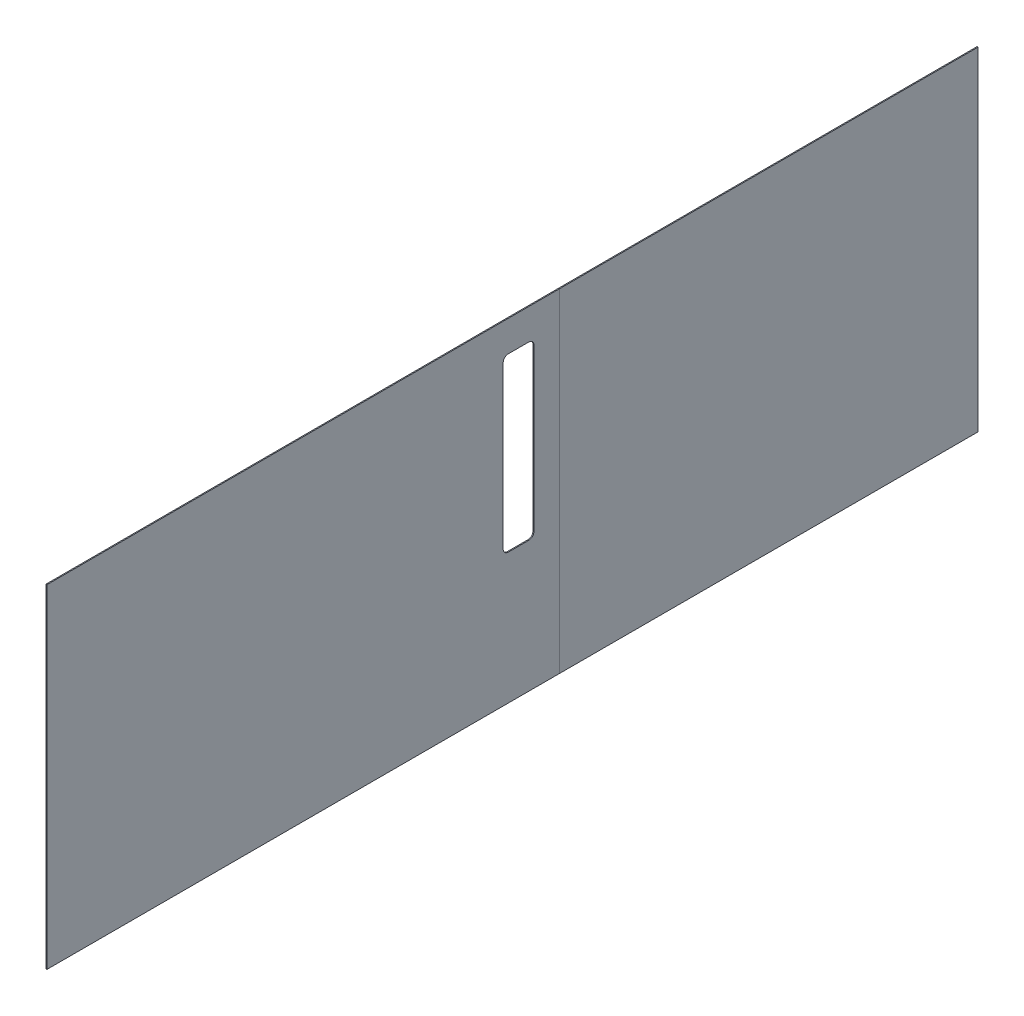
ISO-10303-21;
HEADER;
FILE_DESCRIPTION(('STEP AP214'),'2;1');
FILE_NAME('part.step','',(''),(''),'','','');
FILE_SCHEMA(('AUTOMOTIVE_DESIGN { 1 0 10303 214 1 1 1 1 }'));
ENDSEC;
DATA;
#1=APPLICATION_CONTEXT('core data for automotive mechanical design processes');
#2=APPLICATION_PROTOCOL_DEFINITION('international standard','automotive_design',2000,#1);
#3=PRODUCT_CONTEXT('',#1,'mechanical');
#4=PRODUCT('Part','Part','',(#3));
#5=PRODUCT_RELATED_PRODUCT_CATEGORY('part','',(#4));
#6=PRODUCT_DEFINITION_FORMATION('','',#4);
#7=PRODUCT_DEFINITION_CONTEXT('part definition',#1,'design');
#8=PRODUCT_DEFINITION('design','',#6,#7);
#9=PRODUCT_DEFINITION_SHAPE('','',#8);
#10=(LENGTH_UNIT() NAMED_UNIT(*) SI_UNIT(.MILLI.,.METRE.));
#11=(NAMED_UNIT(*) PLANE_ANGLE_UNIT() SI_UNIT($,.RADIAN.));
#12=(NAMED_UNIT(*) SI_UNIT($,.STERADIAN.) SOLID_ANGLE_UNIT());
#13=UNCERTAINTY_MEASURE_WITH_UNIT(LENGTH_MEASURE(1.E-05),#10,'distance_accuracy_value','');
#14=(GEOMETRIC_REPRESENTATION_CONTEXT(3) GLOBAL_UNCERTAINTY_ASSIGNED_CONTEXT((#13)) GLOBAL_UNIT_ASSIGNED_CONTEXT((#10,
#11,#12)) REPRESENTATION_CONTEXT('',''));
#15=CARTESIAN_POINT('',(0.,0.,0.));
#16=DIRECTION('',(0.,0.,1.));
#17=DIRECTION('',(1.,0.,0.));
#18=AXIS2_PLACEMENT_3D('',#15,#16,#17);
#19=CARTESIAN_POINT('',(-1.88013383391161,0.,0.161176834194605));
#20=DIRECTION('',(0.,-1.,0.));
#21=DIRECTION('',(-0.122526572002682,0.,-0.992465233221432));
#22=AXIS2_PLACEMENT_3D('',#19,#20,#21);
#23=PLANE('',#22);
#24=DIRECTION('',(0.,0.,-1.));
#25=VECTOR('',#24,1.);
#26=CARTESIAN_POINT('',(0.,0.,-0.116579537204451));
#27=LINE('',#26,#25);
#28=CARTESIAN_POINT('',(0.,0.,-0.161876725547665));
#29=VERTEX_POINT('',#28);
#30=CARTESIAN_POINT('',(-2.96125970966621E-11,0.,-816.266075646833));
#31=VERTEX_POINT('',#30);
#32=EDGE_CURVE('E95',#29,#31,#27,.T.);
#33=ORIENTED_EDGE('',*,*,#32,.F.);
#34=DIRECTION('',(-1.,0.,0.));
#35=VECTOR('',#34,1.);
#36=CARTESIAN_POINT('',(0.,0.,-0.161876725547735));
#37=LINE('',#36,#35);
#38=CARTESIAN_POINT('',(-1.90000000000001,0.,-0.161876725547665));
#39=VERTEX_POINT('',#38);
#40=EDGE_CURVE('E98',#29,#39,#37,.T.);
#41=ORIENTED_EDGE('',*,*,#40,.T.);
#42=DIRECTION('',(0.,0.,-1.));
#43=VECTOR('',#42,1.);
#44=CARTESIAN_POINT('',(-1.90000000000001,0.,-0.116579537204382));
#45=LINE('',#44,#43);
#46=CARTESIAN_POINT('',(-1.90000000002961,0.,-816.266075646833));
#47=VERTEX_POINT('',#46);
#48=EDGE_CURVE('E82',#39,#47,#45,.T.);
#49=ORIENTED_EDGE('',*,*,#48,.T.);
#50=DIRECTION('',(1.,0.,1.63868918434673E-13));
#51=VECTOR('',#50,1.);
#52=CARTESIAN_POINT('',(-1.90000000002961,0.,-816.266075646833));
#53=LINE('',#52,#51);
#54=EDGE_CURVE('E89',#47,#31,#53,.T.);
#55=ORIENTED_EDGE('',*,*,#54,.T.);
#56=EDGE_LOOP('',(#33,#41,#49,#55));
#57=FACE_BOUND('',#56,.T.);
#58=ADVANCED_FACE('F43',(#57),#23,.T.);
#59=CARTESIAN_POINT('',(0.,650.,-0.116579537204451));
#60=DIRECTION('',(-1.,0.,0.));
#61=DIRECTION('',(0.,0.,1.));
#62=AXIS2_PLACEMENT_3D('',#59,#60,#61);
#63=PLANE('',#62);
#64=ORIENTED_EDGE('',*,*,#32,.T.);
#65=DIRECTION('',(0.,-1.,0.));
#66=VECTOR('',#65,1.);
#67=CARTESIAN_POINT('',(-2.96125970966621E-11,650.,-816.266075646833));
#68=LINE('',#67,#66);
#69=CARTESIAN_POINT('',(-2.96125970966621E-11,650.,-816.266075646833));
#70=VERTEX_POINT('',#69);
#71=EDGE_CURVE('E86',#70,#31,#68,.T.);
#72=ORIENTED_EDGE('',*,*,#71,.F.);
#73=DIRECTION('',(0.,0.,-1.));
#74=VECTOR('',#73,1.);
#75=CARTESIAN_POINT('',(0.,650.,-0.116579537204451));
#76=LINE('',#75,#74);
#77=CARTESIAN_POINT('',(0.,650.,-0.161876725547735));
#78=VERTEX_POINT('',#77);
#79=EDGE_CURVE('E99',#78,#70,#76,.T.);
#80=ORIENTED_EDGE('',*,*,#79,.F.);
#81=DIRECTION('',(0.,-1.,0.));
#82=VECTOR('',#81,1.);
#83=CARTESIAN_POINT('',(0.,650.,-0.161876725547735));
#84=LINE('',#83,#82);
#85=EDGE_CURVE('E50',#78,#29,#84,.T.);
#86=ORIENTED_EDGE('',*,*,#85,.T.);
#87=EDGE_LOOP('',(#64,#72,#80,#86));
#88=FACE_BOUND('',#87,.T.);
#89=ADVANCED_FACE('F112',(#88),#63,.F.);
#90=CARTESIAN_POINT('',(-1.90000000002961,650.,-816.266075646833));
#91=DIRECTION('',(1.63868918434673E-13,0.,-1.));
#92=DIRECTION('',(-1.,0.,-1.63868918434673E-13));
#93=AXIS2_PLACEMENT_3D('',#90,#91,#92);
#94=PLANE('',#93);
#95=ORIENTED_EDGE('',*,*,#54,.F.);
#96=DIRECTION('',(0.,-1.,0.));
#97=VECTOR('',#96,1.);
#98=CARTESIAN_POINT('',(-1.90000000002961,650.,-816.266075646833));
#99=LINE('',#98,#97);
#100=CARTESIAN_POINT('',(-1.90000000002961,650.,-816.266075646833));
#101=VERTEX_POINT('',#100);
#102=EDGE_CURVE('E65',#101,#47,#99,.T.);
#103=ORIENTED_EDGE('',*,*,#102,.F.);
#104=DIRECTION('',(1.,0.,1.63868918434673E-13));
#105=VECTOR('',#104,1.);
#106=CARTESIAN_POINT('',(-1.90000000002961,650.,-816.266075646833));
#107=LINE('',#106,#105);
#108=EDGE_CURVE('E101',#101,#70,#107,.T.);
#109=ORIENTED_EDGE('',*,*,#108,.T.);
#110=ORIENTED_EDGE('',*,*,#71,.T.);
#111=EDGE_LOOP('',(#95,#103,#109,#110));
#112=FACE_BOUND('',#111,.T.);
#113=ADVANCED_FACE('F90',(#112),#94,.T.);
#114=CARTESIAN_POINT('',(-1.90000000000001,650.,-0.116579537204382));
#115=DIRECTION('',(-1.,0.,0.));
#116=DIRECTION('',(0.,0.,1.));
#117=AXIS2_PLACEMENT_3D('',#114,#115,#116);
#118=PLANE('',#117);
#119=ORIENTED_EDGE('',*,*,#48,.F.);
#120=DIRECTION('',(0.,-1.,0.));
#121=VECTOR('',#120,1.);
#122=CARTESIAN_POINT('',(-1.90000000000001,650.,-0.161876725547666));
#123=LINE('',#122,#121);
#124=CARTESIAN_POINT('',(-1.90000000000001,650.,-0.161876725547665));
#125=VERTEX_POINT('',#124);
#126=EDGE_CURVE('E106',#125,#39,#123,.T.);
#127=ORIENTED_EDGE('',*,*,#126,.F.);
#128=DIRECTION('',(0.,0.,-1.));
#129=VECTOR('',#128,1.);
#130=CARTESIAN_POINT('',(-1.90000000000001,650.,-0.116579537204382));
#131=LINE('',#130,#129);
#132=EDGE_CURVE('E85',#125,#101,#131,.T.);
#133=ORIENTED_EDGE('',*,*,#132,.T.);
#134=ORIENTED_EDGE('',*,*,#102,.T.);
#135=EDGE_LOOP('',(#119,#127,#133,#134));
#136=FACE_BOUND('',#135,.T.);
#137=ADVANCED_FACE('F78',(#136),#118,.T.);
#138=CARTESIAN_POINT('',(0.736600000000003,650.,-0.161876725547762));
#139=DIRECTION('',(0.,1.,0.));
#140=DIRECTION('',(0.992465233221432,0.,-0.122526572002682));
#141=AXIS2_PLACEMENT_3D('',#138,#139,#140);
#142=PLANE('',#141);
#143=ORIENTED_EDGE('',*,*,#79,.T.);
#144=ORIENTED_EDGE('',*,*,#108,.F.);
#145=ORIENTED_EDGE('',*,*,#132,.F.);
#146=DIRECTION('',(1.,0.,0.));
#147=VECTOR('',#146,1.);
#148=CARTESIAN_POINT('',(-1.90000000000001,650.,-0.161876725547666));
#149=LINE('',#148,#147);
#150=EDGE_CURVE('E11',#125,#78,#149,.T.);
#151=ORIENTED_EDGE('',*,*,#150,.T.);
#152=EDGE_LOOP('',(#143,#144,#145,#151));
#153=FACE_BOUND('',#152,.T.);
#154=ADVANCED_FACE('F207',(#153),#142,.T.);
#155=CARTESIAN_POINT('',(0.,650.,1000.));
#156=DIRECTION('',(0.,0.,1.));
#157=DIRECTION('',(1.,0.,0.));
#158=AXIS2_PLACEMENT_3D('',#155,#156,#157);
#159=PLANE('',#158);
#160=DIRECTION('',(-1.,0.,0.));
#161=VECTOR('',#160,1.);
#162=CARTESIAN_POINT('',(0.,0.,1000.));
#163=LINE('',#162,#161);
#164=CARTESIAN_POINT('',(0.,0.,1000.));
#165=VERTEX_POINT('',#164);
#166=CARTESIAN_POINT('',(-1.9,0.,1000.));
#167=VERTEX_POINT('',#166);
#168=EDGE_CURVE('E250',#165,#167,#163,.T.);
#169=ORIENTED_EDGE('',*,*,#168,.F.);
#170=DIRECTION('',(0.,-1.,0.));
#171=VECTOR('',#170,1.);
#172=CARTESIAN_POINT('',(0.,650.,1000.));
#173=LINE('',#172,#171);
#174=CARTESIAN_POINT('',(0.,650.,1000.));
#175=VERTEX_POINT('',#174);
#176=EDGE_CURVE('E217',#175,#165,#173,.T.);
#177=ORIENTED_EDGE('',*,*,#176,.F.);
#178=DIRECTION('',(-1.,0.,0.));
#179=VECTOR('',#178,1.);
#180=CARTESIAN_POINT('',(0.,650.,1000.));
#181=LINE('',#180,#179);
#182=CARTESIAN_POINT('',(-1.9,650.,1000.));
#183=VERTEX_POINT('',#182);
#184=EDGE_CURVE('E304',#175,#183,#181,.T.);
#185=ORIENTED_EDGE('',*,*,#184,.T.);
#186=DIRECTION('',(0.,-1.,0.));
#187=VECTOR('',#186,1.);
#188=CARTESIAN_POINT('',(-1.9,650.,1000.));
#189=LINE('',#188,#187);
#190=EDGE_CURVE('E302',#183,#167,#189,.T.);
#191=ORIENTED_EDGE('',*,*,#190,.T.);
#192=EDGE_LOOP('',(#169,#177,#185,#191));
#193=FACE_BOUND('',#192,.T.);
#194=ADVANCED_FACE('F325',(#193),#159,.T.);
#195=CARTESIAN_POINT('',(100.,580.,110.));
#196=DIRECTION('',(0.,0.,1.));
#197=DIRECTION('',(0.,-1.,0.));
#198=AXIS2_PLACEMENT_3D('',#195,#196,#197);
#199=PLANE('',#198);
#200=DIRECTION('',(-1.,0.,0.));
#201=VECTOR('',#200,1.);
#202=CARTESIAN_POINT('',(100.,265.,110.));
#203=LINE('',#202,#201);
#204=CARTESIAN_POINT('',(0.,265.,110.));
#205=VERTEX_POINT('',#204);
#206=CARTESIAN_POINT('',(-1.9,265.,110.));
#207=VERTEX_POINT('',#206);
#208=EDGE_CURVE('E299',#205,#207,#203,.T.);
#209=ORIENTED_EDGE('',*,*,#208,.T.);
#210=DIRECTION('',(0.,1.,0.));
#211=VECTOR('',#210,1.);
#212=CARTESIAN_POINT('',(-1.9,580.,110.));
#213=LINE('',#212,#211);
#214=CARTESIAN_POINT('',(-1.9,580.,110.));
#215=VERTEX_POINT('',#214);
#216=EDGE_CURVE('E296',#207,#215,#213,.T.);
#217=ORIENTED_EDGE('',*,*,#216,.T.);
#218=DIRECTION('',(-1.,0.,0.));
#219=VECTOR('',#218,1.);
#220=CARTESIAN_POINT('',(100.,580.,110.));
#221=LINE('',#220,#219);
#222=CARTESIAN_POINT('',(0.,580.,110.));
#223=VERTEX_POINT('',#222);
#224=EDGE_CURVE('E294',#223,#215,#221,.T.);
#225=ORIENTED_EDGE('',*,*,#224,.F.);
#226=DIRECTION('',(0.,1.,0.));
#227=VECTOR('',#226,1.);
#228=CARTESIAN_POINT('',(0.,650.,110.));
#229=LINE('',#228,#227);
#230=EDGE_CURVE('E241',#205,#223,#229,.T.);
#231=ORIENTED_EDGE('',*,*,#230,.F.);
#232=EDGE_LOOP('',(#209,#217,#225,#231));
#233=FACE_BOUND('',#232,.T.);
#234=ADVANCED_FACE('F327',(#233),#199,.F.);
#235=CARTESIAN_POINT('',(100.,580.,100.));
#236=DIRECTION('',(-1.,0.,0.));
#237=DIRECTION('',(0.,0.,1.));
#238=AXIS2_PLACEMENT_3D('',#235,#236,#237);
#239=CYLINDRICAL_SURFACE('',#238,10.);
#240=ORIENTED_EDGE('',*,*,#224,.T.);
#241=CARTESIAN_POINT('',(-1.9,580.,100.));
#242=DIRECTION('',(-1.,0.,0.));
#243=DIRECTION('',(0.,0.,-1.));
#244=AXIS2_PLACEMENT_3D('',#241,#242,#243);
#245=CIRCLE('',#244,10.);
#246=CARTESIAN_POINT('',(-1.9,590.,100.));
#247=VERTEX_POINT('',#246);
#248=EDGE_CURVE('E291',#215,#247,#245,.T.);
#249=ORIENTED_EDGE('',*,*,#248,.T.);
#250=DIRECTION('',(-1.,0.,0.));
#251=VECTOR('',#250,1.);
#252=CARTESIAN_POINT('',(100.,590.,100.));
#253=LINE('',#252,#251);
#254=CARTESIAN_POINT('',(0.,590.,100.));
#255=VERTEX_POINT('',#254);
#256=EDGE_CURVE('E289',#255,#247,#253,.T.);
#257=ORIENTED_EDGE('',*,*,#256,.F.);
#258=CARTESIAN_POINT('',(0.,580.,100.));
#259=DIRECTION('',(-1.,0.,0.));
#260=DIRECTION('',(0.,0.,1.));
#261=AXIS2_PLACEMENT_3D('',#258,#259,#260);
#262=CIRCLE('',#261,10.);
#263=EDGE_CURVE('E238',#223,#255,#262,.T.);
#264=ORIENTED_EDGE('',*,*,#263,.F.);
#265=EDGE_LOOP('',(#240,#249,#257,#264));
#266=FACE_BOUND('',#265,.T.);
#267=ADVANCED_FACE('F333',(#266),#239,.F.);
#268=CARTESIAN_POINT('',(100.,590.,60.));
#269=DIRECTION('',(0.,1.,0.));
#270=DIRECTION('',(0.,0.,1.));
#271=AXIS2_PLACEMENT_3D('',#268,#269,#270);
#272=PLANE('',#271);
#273=ORIENTED_EDGE('',*,*,#256,.T.);
#274=DIRECTION('',(0.,0.,-1.));
#275=VECTOR('',#274,1.);
#276=CARTESIAN_POINT('',(-1.9,590.,60.));
#277=LINE('',#276,#275);
#278=CARTESIAN_POINT('',(-1.9,590.,60.));
#279=VERTEX_POINT('',#278);
#280=EDGE_CURVE('E286',#247,#279,#277,.T.);
#281=ORIENTED_EDGE('',*,*,#280,.T.);
#282=DIRECTION('',(-1.,0.,0.));
#283=VECTOR('',#282,1.);
#284=CARTESIAN_POINT('',(100.,590.,60.));
#285=LINE('',#284,#283);
#286=CARTESIAN_POINT('',(0.,590.,60.));
#287=VERTEX_POINT('',#286);
#288=EDGE_CURVE('E284',#287,#279,#285,.T.);
#289=ORIENTED_EDGE('',*,*,#288,.F.);
#290=DIRECTION('',(0.,0.,-1.));
#291=VECTOR('',#290,1.);
#292=CARTESIAN_POINT('',(0.,590.,1000.));
#293=LINE('',#292,#291);
#294=EDGE_CURVE('E235',#255,#287,#293,.T.);
#295=ORIENTED_EDGE('',*,*,#294,.F.);
#296=EDGE_LOOP('',(#273,#281,#289,#295));
#297=FACE_BOUND('',#296,.T.);
#298=ADVANCED_FACE('F378',(#297),#272,.F.);
#299=CARTESIAN_POINT('',(100.,580.,60.));
#300=DIRECTION('',(-1.,0.,0.));
#301=DIRECTION('',(0.,0.,1.));
#302=AXIS2_PLACEMENT_3D('',#299,#300,#301);
#303=CYLINDRICAL_SURFACE('',#302,10.);
#304=ORIENTED_EDGE('',*,*,#288,.T.);
#305=CARTESIAN_POINT('',(-1.9,580.,60.));
#306=DIRECTION('',(-1.,0.,0.));
#307=DIRECTION('',(0.,0.,1.));
#308=AXIS2_PLACEMENT_3D('',#305,#306,#307);
#309=CIRCLE('',#308,10.);
#310=CARTESIAN_POINT('',(-1.9,580.,50.));
#311=VERTEX_POINT('',#310);
#312=EDGE_CURVE('E281',#279,#311,#309,.T.);
#313=ORIENTED_EDGE('',*,*,#312,.T.);
#314=DIRECTION('',(-1.,0.,0.));
#315=VECTOR('',#314,1.);
#316=CARTESIAN_POINT('',(100.,580.,50.));
#317=LINE('',#316,#315);
#318=CARTESIAN_POINT('',(0.,580.,50.));
#319=VERTEX_POINT('',#318);
#320=EDGE_CURVE('E279',#319,#311,#317,.T.);
#321=ORIENTED_EDGE('',*,*,#320,.F.);
#322=CARTESIAN_POINT('',(0.,580.,60.));
#323=DIRECTION('',(-1.,0.,0.));
#324=DIRECTION('',(0.,0.,1.));
#325=AXIS2_PLACEMENT_3D('',#322,#323,#324);
#326=CIRCLE('',#325,10.);
#327=EDGE_CURVE('E232',#287,#319,#326,.T.);
#328=ORIENTED_EDGE('',*,*,#327,.F.);
#329=EDGE_LOOP('',(#304,#313,#321,#328));
#330=FACE_BOUND('',#329,.T.);
#331=ADVANCED_FACE('F374',(#330),#303,.F.);
#332=CARTESIAN_POINT('',(100.,580.,50.));
#333=DIRECTION('',(0.,0.,-1.));
#334=DIRECTION('',(0.,1.,0.));
#335=AXIS2_PLACEMENT_3D('',#332,#333,#334);
#336=PLANE('',#335);
#337=ORIENTED_EDGE('',*,*,#320,.T.);
#338=DIRECTION('',(0.,-1.,0.));
#339=VECTOR('',#338,1.);
#340=CARTESIAN_POINT('',(-1.9,580.,50.));
#341=LINE('',#340,#339);
#342=CARTESIAN_POINT('',(-1.9,265.,50.));
#343=VERTEX_POINT('',#342);
#344=EDGE_CURVE('E276',#311,#343,#341,.T.);
#345=ORIENTED_EDGE('',*,*,#344,.T.);
#346=DIRECTION('',(-1.,0.,0.));
#347=VECTOR('',#346,1.);
#348=CARTESIAN_POINT('',(100.,265.,50.));
#349=LINE('',#348,#347);
#350=CARTESIAN_POINT('',(0.,265.,50.));
#351=VERTEX_POINT('',#350);
#352=EDGE_CURVE('E274',#351,#343,#349,.T.);
#353=ORIENTED_EDGE('',*,*,#352,.F.);
#354=DIRECTION('',(0.,-1.,0.));
#355=VECTOR('',#354,1.);
#356=CARTESIAN_POINT('',(0.,650.,49.9999999999999));
#357=LINE('',#356,#355);
#358=EDGE_CURVE('E229',#319,#351,#357,.T.);
#359=ORIENTED_EDGE('',*,*,#358,.F.);
#360=EDGE_LOOP('',(#337,#345,#353,#359));
#361=FACE_BOUND('',#360,.T.);
#362=ADVANCED_FACE('F370',(#361),#336,.F.);
#363=CARTESIAN_POINT('',(100.,265.,60.));
#364=DIRECTION('',(-1.,0.,0.));
#365=DIRECTION('',(0.,0.,1.));
#366=AXIS2_PLACEMENT_3D('',#363,#364,#365);
#367=CYLINDRICAL_SURFACE('',#366,10.);
#368=ORIENTED_EDGE('',*,*,#352,.T.);
#369=CARTESIAN_POINT('',(-1.9,265.,60.));
#370=DIRECTION('',(-1.,0.,0.));
#371=DIRECTION('',(0.,0.,1.));
#372=AXIS2_PLACEMENT_3D('',#369,#370,#371);
#373=CIRCLE('',#372,10.);
#374=CARTESIAN_POINT('',(-1.9,255.,60.));
#375=VERTEX_POINT('',#374);
#376=EDGE_CURVE('E271',#343,#375,#373,.T.);
#377=ORIENTED_EDGE('',*,*,#376,.T.);
#378=DIRECTION('',(-1.,0.,0.));
#379=VECTOR('',#378,1.);
#380=CARTESIAN_POINT('',(100.,255.,60.));
#381=LINE('',#380,#379);
#382=CARTESIAN_POINT('',(0.,255.,60.));
#383=VERTEX_POINT('',#382);
#384=EDGE_CURVE('E269',#383,#375,#381,.T.);
#385=ORIENTED_EDGE('',*,*,#384,.F.);
#386=CARTESIAN_POINT('',(0.,265.,60.));
#387=DIRECTION('',(-1.,0.,0.));
#388=DIRECTION('',(0.,0.,1.));
#389=AXIS2_PLACEMENT_3D('',#386,#387,#388);
#390=CIRCLE('',#389,10.);
#391=EDGE_CURVE('E226',#351,#383,#390,.T.);
#392=ORIENTED_EDGE('',*,*,#391,.F.);
#393=EDGE_LOOP('',(#368,#377,#385,#392));
#394=FACE_BOUND('',#393,.T.);
#395=ADVANCED_FACE('F366',(#394),#367,.F.);
#396=CARTESIAN_POINT('',(100.,255.,60.));
#397=DIRECTION('',(0.,-1.,0.));
#398=DIRECTION('',(0.,0.,-1.));
#399=AXIS2_PLACEMENT_3D('',#396,#397,#398);
#400=PLANE('',#399);
#401=ORIENTED_EDGE('',*,*,#384,.T.);
#402=DIRECTION('',(0.,0.,1.));
#403=VECTOR('',#402,1.);
#404=CARTESIAN_POINT('',(-1.9,255.,60.));
#405=LINE('',#404,#403);
#406=CARTESIAN_POINT('',(-1.9,255.,100.));
#407=VERTEX_POINT('',#406);
#408=EDGE_CURVE('E266',#375,#407,#405,.T.);
#409=ORIENTED_EDGE('',*,*,#408,.T.);
#410=DIRECTION('',(-1.,0.,0.));
#411=VECTOR('',#410,1.);
#412=CARTESIAN_POINT('',(100.,255.,100.));
#413=LINE('',#412,#411);
#414=CARTESIAN_POINT('',(0.,255.,100.));
#415=VERTEX_POINT('',#414);
#416=EDGE_CURVE('E264',#415,#407,#413,.T.);
#417=ORIENTED_EDGE('',*,*,#416,.F.);
#418=DIRECTION('',(0.,0.,1.));
#419=VECTOR('',#418,1.);
#420=CARTESIAN_POINT('',(0.,254.999999999999,999.999999999999));
#421=LINE('',#420,#419);
#422=EDGE_CURVE('E247',#383,#415,#421,.T.);
#423=ORIENTED_EDGE('',*,*,#422,.F.);
#424=EDGE_LOOP('',(#401,#409,#417,#423));
#425=FACE_BOUND('',#424,.T.);
#426=ADVANCED_FACE('F362',(#425),#400,.F.);
#427=CARTESIAN_POINT('',(100.,265.,100.));
#428=DIRECTION('',(-1.,0.,0.));
#429=DIRECTION('',(0.,0.,1.));
#430=AXIS2_PLACEMENT_3D('',#427,#428,#429);
#431=CYLINDRICAL_SURFACE('',#430,10.);
#432=ORIENTED_EDGE('',*,*,#416,.T.);
#433=CARTESIAN_POINT('',(-1.9,265.,100.));
#434=DIRECTION('',(-1.,0.,0.));
#435=DIRECTION('',(0.,0.,1.));
#436=AXIS2_PLACEMENT_3D('',#433,#434,#435);
#437=CIRCLE('',#436,10.);
#438=EDGE_CURVE('E262',#407,#207,#437,.T.);
#439=ORIENTED_EDGE('',*,*,#438,.T.);
#440=ORIENTED_EDGE('',*,*,#208,.F.);
#441=CARTESIAN_POINT('',(0.,265.,100.));
#442=DIRECTION('',(-1.,0.,0.));
#443=DIRECTION('',(0.,0.,1.));
#444=AXIS2_PLACEMENT_3D('',#441,#442,#443);
#445=CIRCLE('',#444,10.);
#446=EDGE_CURVE('E244',#415,#205,#445,.T.);
#447=ORIENTED_EDGE('',*,*,#446,.F.);
#448=EDGE_LOOP('',(#432,#439,#440,#447));
#449=FACE_BOUND('',#448,.T.);
#450=ADVANCED_FACE('F358',(#449),#431,.F.);
#451=CARTESIAN_POINT('',(-1.9,650.,1000.));
#452=DIRECTION('',(-1.,0.,0.));
#453=DIRECTION('',(0.,0.,1.));
#454=AXIS2_PLACEMENT_3D('',#451,#452,#453);
#455=PLANE('',#454);
#456=ORIENTED_EDGE('',*,*,#438,.F.);
#457=ORIENTED_EDGE('',*,*,#408,.F.);
#458=ORIENTED_EDGE('',*,*,#376,.F.);
#459=ORIENTED_EDGE('',*,*,#344,.F.);
#460=ORIENTED_EDGE('',*,*,#312,.F.);
#461=ORIENTED_EDGE('',*,*,#280,.F.);
#462=ORIENTED_EDGE('',*,*,#248,.F.);
#463=ORIENTED_EDGE('',*,*,#216,.F.);
#464=EDGE_LOOP('',(#456,#457,#458,#459,#460,#461,#462,#463));
#465=FACE_BOUND('',#464,.T.);
#466=DIRECTION('',(0.,0.,-1.));
#467=VECTOR('',#466,1.);
#468=CARTESIAN_POINT('',(-1.9,0.,1000.));
#469=LINE('',#468,#467);
#470=CARTESIAN_POINT('',(-1.90000000000001,0.,0.0452971883438525));
#471=VERTEX_POINT('',#470);
#472=EDGE_CURVE('E254',#167,#471,#469,.T.);
#473=ORIENTED_EDGE('',*,*,#472,.F.);
#474=ORIENTED_EDGE('',*,*,#190,.F.);
#475=DIRECTION('',(0.,0.,-1.));
#476=VECTOR('',#475,1.);
#477=CARTESIAN_POINT('',(-1.9,650.,1000.));
#478=LINE('',#477,#476);
#479=CARTESIAN_POINT('',(-1.90000000000001,650.,0.0452971883438525));
#480=VERTEX_POINT('',#479);
#481=EDGE_CURVE('E259',#183,#480,#478,.T.);
#482=ORIENTED_EDGE('',*,*,#481,.T.);
#483=DIRECTION('',(0.,-1.,0.));
#484=VECTOR('',#483,1.);
#485=CARTESIAN_POINT('',(-1.90000000000001,650.,0.0452971883438525));
#486=LINE('',#485,#484);
#487=EDGE_CURVE('E257',#480,#471,#486,.T.);
#488=ORIENTED_EDGE('',*,*,#487,.T.);
#489=EDGE_LOOP('',(#473,#474,#482,#488));
#490=FACE_BOUND('',#489,.T.);
#491=ADVANCED_FACE('F323',(#465,#490),#455,.T.);
#492=CARTESIAN_POINT('',(0.736599999999987,0.,0.045297188343758));
#493=DIRECTION('',(0.,1.,0.));
#494=DIRECTION('',(1.,0.,0.));
#495=AXIS2_PLACEMENT_3D('',#492,#493,#494);
#496=PLANE('',#495);
#497=ORIENTED_EDGE('',*,*,#472,.T.);
#498=DIRECTION('',(1.,0.,0.));
#499=VECTOR('',#498,1.);
#500=CARTESIAN_POINT('',(-1.90000000000001,0.,0.0452971883438525));
#501=LINE('',#500,#499);
#502=CARTESIAN_POINT('',(0.,0.,0.0452971883437847));
#503=VERTEX_POINT('',#502);
#504=EDGE_CURVE('E199',#471,#503,#501,.T.);
#505=ORIENTED_EDGE('',*,*,#504,.T.);
#506=DIRECTION('',(0.,0.,-1.));
#507=VECTOR('',#506,1.);
#508=CARTESIAN_POINT('',(0.,0.,1000.));
#509=LINE('',#508,#507);
#510=EDGE_CURVE('E223',#165,#503,#509,.T.);
#511=ORIENTED_EDGE('',*,*,#510,.F.);
#512=ORIENTED_EDGE('',*,*,#168,.T.);
#513=EDGE_LOOP('',(#497,#505,#511,#512));
#514=FACE_BOUND('',#513,.T.);
#515=ADVANCED_FACE('F320',(#514),#496,.F.);
#516=CARTESIAN_POINT('',(0.,650.,1000.));
#517=DIRECTION('',(-1.,0.,0.));
#518=DIRECTION('',(0.,0.,1.));
#519=AXIS2_PLACEMENT_3D('',#516,#517,#518);
#520=PLANE('',#519);
#521=ORIENTED_EDGE('',*,*,#422,.T.);
#522=ORIENTED_EDGE('',*,*,#446,.T.);
#523=ORIENTED_EDGE('',*,*,#230,.T.);
#524=ORIENTED_EDGE('',*,*,#263,.T.);
#525=ORIENTED_EDGE('',*,*,#294,.T.);
#526=ORIENTED_EDGE('',*,*,#327,.T.);
#527=ORIENTED_EDGE('',*,*,#358,.T.);
#528=ORIENTED_EDGE('',*,*,#391,.T.);
#529=EDGE_LOOP('',(#521,#522,#523,#524,#525,#526,#527,#528));
#530=FACE_BOUND('',#529,.T.);
#531=ORIENTED_EDGE('',*,*,#510,.T.);
#532=DIRECTION('',(0.,-1.,0.));
#533=VECTOR('',#532,1.);
#534=CARTESIAN_POINT('',(0.,650.,0.0452971883437847));
#535=LINE('',#534,#533);
#536=CARTESIAN_POINT('',(0.,650.,0.0452971883438525));
#537=VERTEX_POINT('',#536);
#538=EDGE_CURVE('E307',#537,#503,#535,.T.);
#539=ORIENTED_EDGE('',*,*,#538,.F.);
#540=DIRECTION('',(0.,0.,-1.));
#541=VECTOR('',#540,1.);
#542=CARTESIAN_POINT('',(0.,650.,1000.));
#543=LINE('',#542,#541);
#544=EDGE_CURVE('E212',#175,#537,#543,.T.);
#545=ORIENTED_EDGE('',*,*,#544,.F.);
#546=ORIENTED_EDGE('',*,*,#176,.T.);
#547=EDGE_LOOP('',(#531,#539,#545,#546));
#548=FACE_BOUND('',#547,.T.);
#549=ADVANCED_FACE('F316',(#530,#548),#520,.F.);
#550=CARTESIAN_POINT('',(-1.88013383391167,650.,-0.277756371398422));
#551=DIRECTION('',(0.,1.,0.));
#552=DIRECTION('',(0.,0.,1.));
#553=AXIS2_PLACEMENT_3D('',#550,#551,#552);
#554=PLANE('',#553);
#555=ORIENTED_EDGE('',*,*,#544,.T.);
#556=DIRECTION('',(-1.,0.,0.));
#557=VECTOR('',#556,1.);
#558=CARTESIAN_POINT('',(0.,650.,0.0452971883437847));
#559=LINE('',#558,#557);
#560=EDGE_CURVE('E210',#537,#480,#559,.T.);
#561=ORIENTED_EDGE('',*,*,#560,.T.);
#562=ORIENTED_EDGE('',*,*,#481,.F.);
#563=ORIENTED_EDGE('',*,*,#184,.F.);
#564=EDGE_LOOP('',(#555,#561,#562,#563));
#565=FACE_BOUND('',#564,.T.);
#566=ADVANCED_FACE('F314',(#565),#554,.T.);
#567=CARTESIAN_POINT('',(-1.90000000000001,0.,0.0452971883438525));
#568=DIRECTION('',(0.,-1.,0.));
#569=DIRECTION('',(0.,0.,1.));
#570=AXIS2_PLACEMENT_3D('',#567,#568,#569);
#571=PLANE('',#570);
#572=ORIENTED_EDGE('',*,*,#40,.F.);
#573=DIRECTION('',(0.,0.,1.));
#574=VECTOR('',#573,1.);
#575=CARTESIAN_POINT('',(0.,0.,-0.0582897686019069));
#576=LINE('',#575,#574);
#577=EDGE_CURVE('E183',#29,#503,#576,.T.);
#578=ORIENTED_EDGE('',*,*,#577,.T.);
#579=ORIENTED_EDGE('',*,*,#504,.F.);
#580=DIRECTION('',(0.,0.,1.));
#581=VECTOR('',#580,1.);
#582=CARTESIAN_POINT('',(-1.90000000000001,0.,0.0452971883438525));
#583=LINE('',#582,#581);
#584=EDGE_CURVE('E196',#39,#471,#583,.T.);
#585=ORIENTED_EDGE('',*,*,#584,.F.);
#586=EDGE_LOOP('',(#572,#578,#579,#585));
#587=FACE_BOUND('',#586,.T.);
#588=ADVANCED_FACE('F197',(#587),#571,.T.);
#589=CARTESIAN_POINT('',(-1.90000000000001,650.,0.0452971883438525));
#590=DIRECTION('',(0.,1.,0.));
#591=DIRECTION('',(0.,0.,-1.));
#592=AXIS2_PLACEMENT_3D('',#589,#590,#591);
#593=PLANE('',#592);
#594=ORIENTED_EDGE('',*,*,#560,.F.);
#595=DIRECTION('',(0.,0.,1.));
#596=VECTOR('',#595,1.);
#597=CARTESIAN_POINT('',(0.,650.,-0.0582897686019069));
#598=LINE('',#597,#596);
#599=EDGE_CURVE('E203',#537,#78,#598,.F.);
#600=ORIENTED_EDGE('',*,*,#599,.T.);
#601=ORIENTED_EDGE('',*,*,#150,.F.);
#602=DIRECTION('',(0.,0.,-1.));
#603=VECTOR('',#602,1.);
#604=CARTESIAN_POINT('',(-1.90000000000001,650.,0.0452971883438525));
#605=LINE('',#604,#603);
#606=EDGE_CURVE('E202',#480,#125,#605,.T.);
#607=ORIENTED_EDGE('',*,*,#606,.F.);
#608=EDGE_LOOP('',(#594,#600,#601,#607));
#609=FACE_BOUND('',#608,.T.);
#610=ADVANCED_FACE('F310',(#609),#593,.T.);
#611=CARTESIAN_POINT('',(-1.90000000000001,325.,-0.0582897686019069));
#612=DIRECTION('',(-1.,0.,0.));
#613=DIRECTION('',(0.,0.,1.));
#614=AXIS2_PLACEMENT_3D('',#611,#612,#613);
#615=PLANE('',#614);
#616=ORIENTED_EDGE('',*,*,#606,.T.);
#617=ORIENTED_EDGE('',*,*,#126,.T.);
#618=ORIENTED_EDGE('',*,*,#584,.T.);
#619=ORIENTED_EDGE('',*,*,#487,.F.);
#620=EDGE_LOOP('',(#616,#617,#618,#619));
#621=FACE_BOUND('',#620,.T.);
#622=ADVANCED_FACE('F205',(#621),#615,.T.);
#623=CARTESIAN_POINT('',(0.,325.,-0.0582897686019069));
#624=DIRECTION('',(-1.,0.,0.));
#625=DIRECTION('',(0.,0.,1.));
#626=AXIS2_PLACEMENT_3D('',#623,#624,#625);
#627=PLANE('',#626);
#628=ORIENTED_EDGE('',*,*,#599,.F.);
#629=ORIENTED_EDGE('',*,*,#538,.T.);
#630=ORIENTED_EDGE('',*,*,#577,.F.);
#631=ORIENTED_EDGE('',*,*,#85,.F.);
#632=EDGE_LOOP('',(#628,#629,#630,#631));
#633=FACE_BOUND('',#632,.T.);
#634=ADVANCED_FACE('F311',(#633),#627,.F.);
#635=CLOSED_SHELL('',(#58,#89,#113,#137,#154,#194,#234,#267,#298,#331,#362,#395,#426,#450,#491,
#515,#549,#566,#588,#610,#622,#634));
#636=MANIFOLD_SOLID_BREP('B2',#635);
#637=ADVANCED_BREP_SHAPE_REPRESENTATION('',(#18,#636),#14);
#638=SHAPE_DEFINITION_REPRESENTATION(#9,#637);
ENDSEC;
END-ISO-10303-21;
